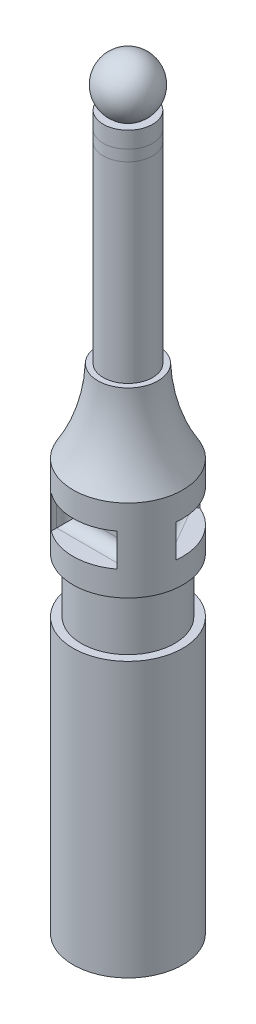
ISO-10303-21;
HEADER;
FILE_DESCRIPTION(('STEP AP214'),'2;1');
FILE_NAME('part.step','',(''),(''),'','','');
FILE_SCHEMA(('AUTOMOTIVE_DESIGN { 1 0 10303 214 1 1 1 1 }'));
ENDSEC;
DATA;
#1=APPLICATION_CONTEXT('core data for automotive mechanical design processes');
#2=APPLICATION_PROTOCOL_DEFINITION('international standard','automotive_design',2000,#1);
#3=PRODUCT_CONTEXT('',#1,'mechanical');
#4=PRODUCT('Part','Part','',(#3));
#5=PRODUCT_RELATED_PRODUCT_CATEGORY('part','',(#4));
#6=PRODUCT_DEFINITION_FORMATION('','',#4);
#7=PRODUCT_DEFINITION_CONTEXT('part definition',#1,'design');
#8=PRODUCT_DEFINITION('design','',#6,#7);
#9=PRODUCT_DEFINITION_SHAPE('','',#8);
#10=(LENGTH_UNIT() NAMED_UNIT(*) SI_UNIT(.MILLI.,.METRE.));
#11=(NAMED_UNIT(*) PLANE_ANGLE_UNIT() SI_UNIT($,.RADIAN.));
#12=(NAMED_UNIT(*) SI_UNIT($,.STERADIAN.) SOLID_ANGLE_UNIT());
#13=UNCERTAINTY_MEASURE_WITH_UNIT(LENGTH_MEASURE(1.E-05),#10,'distance_accuracy_value','');
#14=(GEOMETRIC_REPRESENTATION_CONTEXT(3) GLOBAL_UNCERTAINTY_ASSIGNED_CONTEXT((#13)) GLOBAL_UNIT_ASSIGNED_CONTEXT((#10,
#11,#12)) REPRESENTATION_CONTEXT('',''));
#15=CARTESIAN_POINT('',(0.,0.,0.));
#16=DIRECTION('',(0.,0.,1.));
#17=DIRECTION('',(1.,0.,0.));
#18=AXIS2_PLACEMENT_3D('',#15,#16,#17);
#19=CARTESIAN_POINT('',(0.,91.4579676347439,0.));
#20=DIRECTION('',(0.,1.,0.));
#21=DIRECTION('',(-1.,0.,0.));
#22=AXIS2_PLACEMENT_3D('',#19,#20,#21);
#23=CYLINDRICAL_SURFACE('',#22,4.5);
#24=CARTESIAN_POINT('',(0.,91.4579676347439,0.));
#25=DIRECTION('',(0.,1.,0.));
#26=DIRECTION('',(-1.,0.,0.));
#27=AXIS2_PLACEMENT_3D('',#24,#25,#26);
#28=CIRCLE('',#27,4.5);
#29=CARTESIAN_POINT('',(-4.50000000000001,91.4579676347439,0.));
#30=VERTEX_POINT('',#29);
#31=EDGE_CURVE('E11',#30,#30,#28,.T.);
#32=ORIENTED_EDGE('',*,*,#31,.T.);
#33=EDGE_LOOP('',(#32));
#34=FACE_BOUND('',#33,.T.);
#35=CARTESIAN_POINT('',(0.,93.4579676347439,0.));
#36=DIRECTION('',(0.,1.,0.));
#37=DIRECTION('',(-1.,0.,0.));
#38=AXIS2_PLACEMENT_3D('',#35,#36,#37);
#39=CIRCLE('',#38,4.5);
#40=CARTESIAN_POINT('',(-4.50000000000001,93.4579676347439,0.));
#41=VERTEX_POINT('',#40);
#42=EDGE_CURVE('E47',#41,#41,#39,.T.);
#43=ORIENTED_EDGE('',*,*,#42,.F.);
#44=EDGE_LOOP('',(#43));
#45=FACE_BOUND('',#44,.T.);
#46=ADVANCED_FACE('F44',(#34,#45),#23,.T.);
#47=CARTESIAN_POINT('',(0.,91.4579676347439,0.));
#48=DIRECTION('',(0.,1.,0.));
#49=DIRECTION('',(-1.,0.,0.));
#50=AXIS2_PLACEMENT_3D('',#47,#48,#49);
#51=PLANE('',#50);
#52=ORIENTED_EDGE('',*,*,#31,.F.);
#53=EDGE_LOOP('',(#52));
#54=FACE_BOUND('',#53,.T.);
#55=ADVANCED_FACE('F59',(#54),#51,.F.);
#56=CARTESIAN_POINT('',(0.,93.4579676347439,0.));
#57=DIRECTION('',(0.,1.,0.));
#58=DIRECTION('',(-1.,0.,0.));
#59=AXIS2_PLACEMENT_3D('',#56,#57,#58);
#60=PLANE('',#59);
#61=ORIENTED_EDGE('',*,*,#42,.T.);
#62=EDGE_LOOP('',(#61));
#63=FACE_BOUND('',#62,.T.);
#64=ADVANCED_FACE('F56',(#63),#60,.T.);
#65=CLOSED_SHELL('',(#46,#55,#64));
#66=MANIFOLD_SOLID_BREP('B2',#65);
#67=CARTESIAN_POINT('',(0.,64.0327986592427,0.));
#68=DIRECTION('',(0.,1.,0.));
#69=DIRECTION('',(-1.,0.,0.));
#70=AXIS2_PLACEMENT_3D('',#67,#68,#69);
#71=CYLINDRICAL_SURFACE('',#70,4.5);
#72=CARTESIAN_POINT('',(0.,56.4579676347439,0.));
#73=DIRECTION('',(0.,1.,0.));
#74=DIRECTION('',(-1.,0.,0.));
#75=AXIS2_PLACEMENT_3D('',#72,#73,#74);
#76=CIRCLE('',#75,4.5);
#77=CARTESIAN_POINT('',(-4.5,56.4579676347439,0.));
#78=VERTEX_POINT('',#77);
#79=EDGE_CURVE('E354',#78,#78,#76,.T.);
#80=ORIENTED_EDGE('',*,*,#79,.T.);
#81=EDGE_LOOP('',(#80));
#82=FACE_BOUND('',#81,.T.);
#83=CARTESIAN_POINT('',(0.,91.4579676347439,0.));
#84=DIRECTION('',(0.,1.,0.));
#85=DIRECTION('',(-1.,0.,0.));
#86=AXIS2_PLACEMENT_3D('',#83,#84,#85);
#87=CIRCLE('',#86,4.5);
#88=CARTESIAN_POINT('',(-4.50000000000001,91.4579676347439,0.));
#89=VERTEX_POINT('',#88);
#90=EDGE_CURVE('E280',#89,#89,#87,.T.);
#91=ORIENTED_EDGE('',*,*,#90,.F.);
#92=EDGE_LOOP('',(#91));
#93=FACE_BOUND('',#92,.T.);
#94=ADVANCED_FACE('F84',(#82,#93),#71,.T.);
#95=CARTESIAN_POINT('',(-4.5,56.4579676347439,0.));
#96=DIRECTION('',(0.,1.,0.));
#97=DIRECTION('',(-1.,0.,0.));
#98=AXIS2_PLACEMENT_3D('',#95,#96,#97);
#99=PLANE('',#98);
#100=CARTESIAN_POINT('',(0.,56.4579676347439,0.));
#101=DIRECTION('',(0.,1.,0.));
#102=DIRECTION('',(-1.,0.,0.));
#103=AXIS2_PLACEMENT_3D('',#100,#101,#102);
#104=CIRCLE('',#103,5.5);
#105=CARTESIAN_POINT('',(-5.5,56.4579676347439,0.));
#106=VERTEX_POINT('',#105);
#107=EDGE_CURVE('E359',#106,#106,#104,.T.);
#108=ORIENTED_EDGE('',*,*,#107,.T.);
#109=EDGE_LOOP('',(#108));
#110=FACE_BOUND('',#109,.T.);
#111=ORIENTED_EDGE('',*,*,#79,.F.);
#112=EDGE_LOOP('',(#111));
#113=FACE_BOUND('',#112,.T.);
#114=ADVANCED_FACE('F325',(#110,#113),#99,.T.);
#115=CARTESIAN_POINT('',(0.,57.5167754109723,0.));
#116=DIRECTION('',(0.,1.,0.));
#117=DIRECTION('',(-1.,0.,0.));
#118=AXIS2_PLACEMENT_3D('',#115,#116,#117);
#119=TOROIDAL_SURFACE('',#118,36.2793592540949,30.7975653258442);
#120=CARTESIAN_POINT('',(0.,41.4579676347439,0.));
#121=DIRECTION('',(0.,1.,0.));
#122=DIRECTION('',(-1.,0.,0.));
#123=AXIS2_PLACEMENT_3D('',#120,#121,#122);
#124=CIRCLE('',#123,10.);
#125=CARTESIAN_POINT('',(-10.,41.4579676347439,0.));
#126=VERTEX_POINT('',#125);
#127=EDGE_CURVE('E455',#126,#126,#124,.T.);
#128=ORIENTED_EDGE('',*,*,#127,.T.);
#129=EDGE_LOOP('',(#128));
#130=FACE_BOUND('',#129,.T.);
#131=ORIENTED_EDGE('',*,*,#107,.F.);
#132=EDGE_LOOP('',(#131));
#133=FACE_BOUND('',#132,.T.);
#134=ADVANCED_FACE('F332',(#130,#133),#119,.F.);
#135=CARTESIAN_POINT('',(0.,64.0327986592427,0.));
#136=DIRECTION('',(0.,1.,0.));
#137=DIRECTION('',(-1.,0.,0.));
#138=AXIS2_PLACEMENT_3D('',#135,#136,#137);
#139=CYLINDRICAL_SURFACE('',#138,10.);
#140=DIRECTION('',(0.,1.,0.));
#141=VECTOR('',#140,1.);
#142=CARTESIAN_POINT('',(-9.92820323027549,64.0327986592427,1.19615242270674));
#143=LINE('',#142,#141);
#144=CARTESIAN_POINT('',(-9.92820323027549,30.9579676347439,1.19615242270674));
#145=VERTEX_POINT('',#144);
#146=CARTESIAN_POINT('',(-9.92820323027549,36.9579676347439,1.19615242270674));
#147=VERTEX_POINT('',#146);
#148=EDGE_CURVE('E229',#145,#147,#143,.T.);
#149=ORIENTED_EDGE('',*,*,#148,.F.);
#150=CARTESIAN_POINT('',(0.,30.9579676347439,0.));
#151=DIRECTION('',(0.,-1.,0.));
#152=DIRECTION('',(1.,0.,0.));
#153=AXIS2_PLACEMENT_3D('',#150,#151,#152);
#154=CIRCLE('',#153,10.);
#155=CARTESIAN_POINT('',(-3.9282032302756,30.9579676347439,-9.19615242270659));
#156=VERTEX_POINT('',#155);
#157=EDGE_CURVE('E227',#156,#145,#154,.F.);
#158=ORIENTED_EDGE('',*,*,#157,.F.);
#159=DIRECTION('',(0.,1.,0.));
#160=VECTOR('',#159,1.);
#161=CARTESIAN_POINT('',(-3.9282032302756,64.0327986592427,-9.19615242270659));
#162=LINE('',#161,#160);
#163=CARTESIAN_POINT('',(-3.9282032302756,36.9579676347439,-9.19615242270659));
#164=VERTEX_POINT('',#163);
#165=EDGE_CURVE('E211',#164,#156,#162,.F.);
#166=ORIENTED_EDGE('',*,*,#165,.F.);
#167=CARTESIAN_POINT('',(0.,36.9579676347439,0.));
#168=DIRECTION('',(0.,1.,0.));
#169=DIRECTION('',(-1.,0.,0.));
#170=AXIS2_PLACEMENT_3D('',#167,#168,#169);
#171=CIRCLE('',#170,10.);
#172=EDGE_CURVE('E217',#147,#164,#171,.F.);
#173=ORIENTED_EDGE('',*,*,#172,.F.);
#174=EDGE_LOOP('',(#149,#158,#166,#173));
#175=FACE_BOUND('',#174,.T.);
#176=DIRECTION('',(0.,1.,0.));
#177=VECTOR('',#176,1.);
#178=CARTESIAN_POINT('',(3.92820323027545,64.0327986592427,-9.19615242270666));
#179=LINE('',#178,#177);
#180=CARTESIAN_POINT('',(3.92820323027546,30.9579676347439,-9.19615242270665));
#181=VERTEX_POINT('',#180);
#182=CARTESIAN_POINT('',(3.92820323027546,36.9579676347439,-9.19615242270665));
#183=VERTEX_POINT('',#182);
#184=EDGE_CURVE('E222',#181,#183,#179,.T.);
#185=ORIENTED_EDGE('',*,*,#184,.F.);
#186=CARTESIAN_POINT('',(0.,30.9579676347439,0.));
#187=DIRECTION('',(0.,-1.,0.));
#188=DIRECTION('',(1.,0.,0.));
#189=AXIS2_PLACEMENT_3D('',#186,#187,#188);
#190=CIRCLE('',#189,10.);
#191=CARTESIAN_POINT('',(9.92820323027552,30.9579676347439,1.19615242270658));
#192=VERTEX_POINT('',#191);
#193=EDGE_CURVE('E410',#192,#181,#190,.F.);
#194=ORIENTED_EDGE('',*,*,#193,.F.);
#195=DIRECTION('',(0.,1.,0.));
#196=VECTOR('',#195,1.);
#197=CARTESIAN_POINT('',(9.92820323027551,64.0327986592427,1.19615242270657));
#198=LINE('',#197,#196);
#199=CARTESIAN_POINT('',(9.92820323027552,36.9579676347439,1.19615242270657));
#200=VERTEX_POINT('',#199);
#201=EDGE_CURVE('E407',#200,#192,#198,.F.);
#202=ORIENTED_EDGE('',*,*,#201,.F.);
#203=CARTESIAN_POINT('',(0.,36.9579676347439,0.));
#204=DIRECTION('',(0.,1.,0.));
#205=DIRECTION('',(-1.,0.,0.));
#206=AXIS2_PLACEMENT_3D('',#203,#204,#205);
#207=CIRCLE('',#206,10.);
#208=EDGE_CURVE('E392',#183,#200,#207,.F.);
#209=ORIENTED_EDGE('',*,*,#208,.F.);
#210=EDGE_LOOP('',(#185,#194,#202,#209));
#211=FACE_BOUND('',#210,.T.);
#212=DIRECTION('',(0.,1.,0.));
#213=VECTOR('',#212,1.);
#214=CARTESIAN_POINT('',(6.,64.0327986592427,8.));
#215=LINE('',#214,#213);
#216=CARTESIAN_POINT('',(6.,30.9579676347439,8.));
#217=VERTEX_POINT('',#216);
#218=CARTESIAN_POINT('',(6.,36.9579676347439,8.));
#219=VERTEX_POINT('',#218);
#220=EDGE_CURVE('E371',#217,#219,#215,.T.);
#221=ORIENTED_EDGE('',*,*,#220,.F.);
#222=CARTESIAN_POINT('',(0.,30.9579676347439,0.));
#223=DIRECTION('',(0.,-1.,0.));
#224=DIRECTION('',(0.,0.,-1.));
#225=AXIS2_PLACEMENT_3D('',#222,#223,#224);
#226=CIRCLE('',#225,10.);
#227=CARTESIAN_POINT('',(-6.,30.9579676347439,7.99999999999999));
#228=VERTEX_POINT('',#227);
#229=EDGE_CURVE('E368',#228,#217,#226,.F.);
#230=ORIENTED_EDGE('',*,*,#229,.F.);
#231=DIRECTION('',(0.,1.,0.));
#232=VECTOR('',#231,1.);
#233=CARTESIAN_POINT('',(-6.,64.0327986592427,7.99999999999999));
#234=LINE('',#233,#232);
#235=CARTESIAN_POINT('',(-6.,36.9579676347439,7.99999999999999));
#236=VERTEX_POINT('',#235);
#237=EDGE_CURVE('E365',#236,#228,#234,.F.);
#238=ORIENTED_EDGE('',*,*,#237,.F.);
#239=CARTESIAN_POINT('',(0.,36.9579676347439,0.));
#240=DIRECTION('',(0.,1.,0.));
#241=DIRECTION('',(0.,0.,1.));
#242=AXIS2_PLACEMENT_3D('',#239,#240,#241);
#243=CIRCLE('',#242,10.);
#244=EDGE_CURVE('E357',#219,#236,#243,.F.);
#245=ORIENTED_EDGE('',*,*,#244,.F.);
#246=EDGE_LOOP('',(#221,#230,#238,#245));
#247=FACE_BOUND('',#246,.T.);
#248=CARTESIAN_POINT('',(0.,26.4579676347439,0.));
#249=DIRECTION('',(0.,1.,0.));
#250=DIRECTION('',(-1.,0.,0.));
#251=AXIS2_PLACEMENT_3D('',#248,#249,#250);
#252=CIRCLE('',#251,10.);
#253=CARTESIAN_POINT('',(-9.99999999999999,26.4579676347439,0.));
#254=VERTEX_POINT('',#253);
#255=EDGE_CURVE('E452',#254,#254,#252,.T.);
#256=ORIENTED_EDGE('',*,*,#255,.T.);
#257=EDGE_LOOP('',(#256));
#258=FACE_BOUND('',#257,.T.);
#259=ORIENTED_EDGE('',*,*,#127,.F.);
#260=EDGE_LOOP('',(#259));
#261=FACE_BOUND('',#260,.T.);
#262=ADVANCED_FACE('F224',(#175,#211,#247,#258,#261),#139,.T.);
#263=CARTESIAN_POINT('',(-8.49999999999999,26.4579676347439,0.));
#264=DIRECTION('',(0.,-1.,0.));
#265=DIRECTION('',(1.,0.,0.));
#266=AXIS2_PLACEMENT_3D('',#263,#264,#265);
#267=PLANE('',#266);
#268=CARTESIAN_POINT('',(0.,26.4579676347439,0.));
#269=DIRECTION('',(0.,1.,0.));
#270=DIRECTION('',(-1.,0.,0.));
#271=AXIS2_PLACEMENT_3D('',#268,#269,#270);
#272=CIRCLE('',#271,8.5);
#273=CARTESIAN_POINT('',(-8.49999999999999,26.4579676347439,0.));
#274=VERTEX_POINT('',#273);
#275=EDGE_CURVE('E449',#274,#274,#272,.T.);
#276=ORIENTED_EDGE('',*,*,#275,.T.);
#277=EDGE_LOOP('',(#276));
#278=FACE_BOUND('',#277,.T.);
#279=ORIENTED_EDGE('',*,*,#255,.F.);
#280=EDGE_LOOP('',(#279));
#281=FACE_BOUND('',#280,.T.);
#282=ADVANCED_FACE('F467',(#278,#281),#267,.T.);
#283=CARTESIAN_POINT('',(0.,64.0327986592427,0.));
#284=DIRECTION('',(0.,1.,0.));
#285=DIRECTION('',(-1.,0.,0.));
#286=AXIS2_PLACEMENT_3D('',#283,#284,#285);
#287=CYLINDRICAL_SURFACE('',#286,8.5);
#288=CARTESIAN_POINT('',(0.,16.4579676347439,0.));
#289=DIRECTION('',(0.,1.,0.));
#290=DIRECTION('',(-1.,0.,0.));
#291=AXIS2_PLACEMENT_3D('',#288,#289,#290);
#292=CIRCLE('',#291,8.49999999999999);
#293=CARTESIAN_POINT('',(-8.49999999999999,16.4579676347439,0.));
#294=VERTEX_POINT('',#293);
#295=EDGE_CURVE('E446',#294,#294,#292,.T.);
#296=ORIENTED_EDGE('',*,*,#295,.T.);
#297=EDGE_LOOP('',(#296));
#298=FACE_BOUND('',#297,.T.);
#299=ORIENTED_EDGE('',*,*,#275,.F.);
#300=EDGE_LOOP('',(#299));
#301=FACE_BOUND('',#300,.T.);
#302=ADVANCED_FACE('F472',(#298,#301),#287,.T.);
#303=CARTESIAN_POINT('',(-9.99999999999999,16.4579676347439,0.));
#304=DIRECTION('',(0.,1.,0.));
#305=DIRECTION('',(-1.,0.,0.));
#306=AXIS2_PLACEMENT_3D('',#303,#304,#305);
#307=PLANE('',#306);
#308=CARTESIAN_POINT('',(0.,16.4579676347439,0.));
#309=DIRECTION('',(0.,1.,0.));
#310=DIRECTION('',(-1.,0.,0.));
#311=AXIS2_PLACEMENT_3D('',#308,#309,#310);
#312=CIRCLE('',#311,10.);
#313=CARTESIAN_POINT('',(-9.99999999999999,16.4579676347439,0.));
#314=VERTEX_POINT('',#313);
#315=EDGE_CURVE('E443',#314,#314,#312,.T.);
#316=ORIENTED_EDGE('',*,*,#315,.T.);
#317=EDGE_LOOP('',(#316));
#318=FACE_BOUND('',#317,.T.);
#319=ORIENTED_EDGE('',*,*,#295,.F.);
#320=EDGE_LOOP('',(#319));
#321=FACE_BOUND('',#320,.T.);
#322=ADVANCED_FACE('F476',(#318,#321),#307,.T.);
#323=CARTESIAN_POINT('',(0.,64.0327986592427,0.));
#324=DIRECTION('',(0.,1.,0.));
#325=DIRECTION('',(-1.,0.,0.));
#326=AXIS2_PLACEMENT_3D('',#323,#324,#325);
#327=CYLINDRICAL_SURFACE('',#326,10.);
#328=CARTESIAN_POINT('',(0.,-33.5420323652561,0.));
#329=DIRECTION('',(0.,1.,0.));
#330=DIRECTION('',(-1.,0.,0.));
#331=AXIS2_PLACEMENT_3D('',#328,#329,#330);
#332=CIRCLE('',#331,10.);
#333=CARTESIAN_POINT('',(-9.99999999999999,-33.5420323652561,0.));
#334=VERTEX_POINT('',#333);
#335=EDGE_CURVE('E435',#334,#334,#332,.T.);
#336=ORIENTED_EDGE('',*,*,#335,.T.);
#337=EDGE_LOOP('',(#336));
#338=FACE_BOUND('',#337,.T.);
#339=ORIENTED_EDGE('',*,*,#315,.F.);
#340=EDGE_LOOP('',(#339));
#341=FACE_BOUND('',#340,.T.);
#342=ADVANCED_FACE('F480',(#338,#341),#327,.T.);
#343=CARTESIAN_POINT('',(-9.99999999999999,-33.5420323652561,0.));
#344=DIRECTION('',(0.,-1.,0.));
#345=DIRECTION('',(1.,0.,0.));
#346=AXIS2_PLACEMENT_3D('',#343,#344,#345);
#347=PLANE('',#346);
#348=ORIENTED_EDGE('',*,*,#335,.F.);
#349=EDGE_LOOP('',(#348));
#350=FACE_BOUND('',#349,.T.);
#351=ADVANCED_FACE('F484',(#350),#347,.T.);
#352=CARTESIAN_POINT('',(6.,36.9579676347439,5.));
#353=DIRECTION('',(1.,0.,0.));
#354=DIRECTION('',(0.,0.,-1.));
#355=AXIS2_PLACEMENT_3D('',#352,#353,#354);
#356=PLANE('',#355);
#357=DIRECTION('',(0.,0.,1.));
#358=VECTOR('',#357,1.);
#359=CARTESIAN_POINT('',(6.,36.9579676347439,5.));
#360=LINE('',#359,#358);
#361=CARTESIAN_POINT('',(6.,36.9579676347439,7.));
#362=VERTEX_POINT('',#361);
#363=EDGE_CURVE('E404',#362,#219,#360,.T.);
#364=ORIENTED_EDGE('',*,*,#363,.F.);
#365=DIRECTION('',(0.,1.,0.));
#366=VECTOR('',#365,1.);
#367=CARTESIAN_POINT('',(6.,36.9579676347439,7.));
#368=LINE('',#367,#366);
#369=CARTESIAN_POINT('',(6.,30.9579676347439,7.));
#370=VERTEX_POINT('',#369);
#371=EDGE_CURVE('E386',#362,#370,#368,.F.);
#372=ORIENTED_EDGE('',*,*,#371,.T.);
#373=DIRECTION('',(0.,0.,1.));
#374=VECTOR('',#373,1.);
#375=CARTESIAN_POINT('',(6.,30.9579676347439,5.));
#376=LINE('',#375,#374);
#377=EDGE_CURVE('E433',#370,#217,#376,.T.);
#378=ORIENTED_EDGE('',*,*,#377,.T.);
#379=ORIENTED_EDGE('',*,*,#220,.T.);
#380=EDGE_LOOP('',(#364,#372,#378,#379));
#381=FACE_BOUND('',#380,.T.);
#382=ADVANCED_FACE('F488',(#381),#356,.F.);
#383=CARTESIAN_POINT('',(-6.,30.9579676347439,5.));
#384=DIRECTION('',(0.,-1.,0.));
#385=DIRECTION('',(0.,0.,-1.));
#386=AXIS2_PLACEMENT_3D('',#383,#384,#385);
#387=PLANE('',#386);
#388=ORIENTED_EDGE('',*,*,#377,.F.);
#389=DIRECTION('',(1.,0.,0.));
#390=VECTOR('',#389,1.);
#391=CARTESIAN_POINT('',(-6.,30.9579676347439,7.));
#392=LINE('',#391,#390);
#393=CARTESIAN_POINT('',(-6.,30.9579676347439,7.));
#394=VERTEX_POINT('',#393);
#395=EDGE_CURVE('E383',#370,#394,#392,.F.);
#396=ORIENTED_EDGE('',*,*,#395,.T.);
#397=DIRECTION('',(0.,0.,1.));
#398=VECTOR('',#397,1.);
#399=CARTESIAN_POINT('',(-6.,30.9579676347439,5.));
#400=LINE('',#399,#398);
#401=EDGE_CURVE('E436',#394,#228,#400,.T.);
#402=ORIENTED_EDGE('',*,*,#401,.T.);
#403=ORIENTED_EDGE('',*,*,#229,.T.);
#404=EDGE_LOOP('',(#388,#396,#402,#403));
#405=FACE_BOUND('',#404,.T.);
#406=ADVANCED_FACE('F492',(#405),#387,.F.);
#407=CARTESIAN_POINT('',(-6.,36.9579676347439,5.));
#408=DIRECTION('',(-1.,0.,0.));
#409=DIRECTION('',(0.,-1.,0.));
#410=AXIS2_PLACEMENT_3D('',#407,#408,#409);
#411=PLANE('',#410);
#412=ORIENTED_EDGE('',*,*,#401,.F.);
#413=DIRECTION('',(0.,-1.,0.));
#414=VECTOR('',#413,1.);
#415=CARTESIAN_POINT('',(-6.,36.9579676347439,7.));
#416=LINE('',#415,#414);
#417=CARTESIAN_POINT('',(-6.,36.9579676347439,7.));
#418=VERTEX_POINT('',#417);
#419=EDGE_CURVE('E390',#394,#418,#416,.F.);
#420=ORIENTED_EDGE('',*,*,#419,.T.);
#421=DIRECTION('',(0.,0.,1.));
#422=VECTOR('',#421,1.);
#423=CARTESIAN_POINT('',(-6.,36.9579676347439,5.));
#424=LINE('',#423,#422);
#425=EDGE_CURVE('E438',#418,#236,#424,.T.);
#426=ORIENTED_EDGE('',*,*,#425,.T.);
#427=ORIENTED_EDGE('',*,*,#237,.T.);
#428=EDGE_LOOP('',(#412,#420,#426,#427));
#429=FACE_BOUND('',#428,.T.);
#430=ADVANCED_FACE('F498',(#429),#411,.F.);
#431=CARTESIAN_POINT('',(-6.,36.9579676347439,5.));
#432=DIRECTION('',(0.,1.,0.));
#433=DIRECTION('',(0.,0.,1.));
#434=AXIS2_PLACEMENT_3D('',#431,#432,#433);
#435=PLANE('',#434);
#436=ORIENTED_EDGE('',*,*,#425,.F.);
#437=DIRECTION('',(-1.,0.,0.));
#438=VECTOR('',#437,1.);
#439=CARTESIAN_POINT('',(-6.,36.9579676347439,7.));
#440=LINE('',#439,#438);
#441=EDGE_CURVE('E388',#418,#362,#440,.F.);
#442=ORIENTED_EDGE('',*,*,#441,.T.);
#443=ORIENTED_EDGE('',*,*,#363,.T.);
#444=ORIENTED_EDGE('',*,*,#244,.T.);
#445=EDGE_LOOP('',(#436,#442,#443,#444));
#446=FACE_BOUND('',#445,.T.);
#447=ADVANCED_FACE('F494',(#446),#435,.F.);
#448=CARTESIAN_POINT('',(0.,0.,5.));
#449=DIRECTION('',(0.,0.,1.));
#450=DIRECTION('',(1.,0.,0.));
#451=AXIS2_PLACEMENT_3D('',#448,#449,#450);
#452=PLANE('',#451);
#453=DIRECTION('',(0.,-1.,0.));
#454=VECTOR('',#453,1.);
#455=CARTESIAN_POINT('',(-3.99999999999999,0.,5.));
#456=LINE('',#455,#454);
#457=CARTESIAN_POINT('',(-4.,34.9579676347439,5.));
#458=VERTEX_POINT('',#457);
#459=CARTESIAN_POINT('',(-4.,32.9579676347439,5.));
#460=VERTEX_POINT('',#459);
#461=EDGE_CURVE('E374',#458,#460,#456,.T.);
#462=ORIENTED_EDGE('',*,*,#461,.T.);
#463=DIRECTION('',(1.,0.,0.));
#464=VECTOR('',#463,1.);
#465=CARTESIAN_POINT('',(0.,32.9579676347439,5.));
#466=LINE('',#465,#464);
#467=CARTESIAN_POINT('',(4.,32.9579676347439,5.));
#468=VERTEX_POINT('',#467);
#469=EDGE_CURVE('E380',#460,#468,#466,.T.);
#470=ORIENTED_EDGE('',*,*,#469,.T.);
#471=DIRECTION('',(0.,1.,0.));
#472=VECTOR('',#471,1.);
#473=CARTESIAN_POINT('',(4.,0.,5.));
#474=LINE('',#473,#472);
#475=CARTESIAN_POINT('',(4.,34.9579676347439,5.));
#476=VERTEX_POINT('',#475);
#477=EDGE_CURVE('E378',#468,#476,#474,.T.);
#478=ORIENTED_EDGE('',*,*,#477,.T.);
#479=DIRECTION('',(-1.,0.,0.));
#480=VECTOR('',#479,1.);
#481=CARTESIAN_POINT('',(0.,34.9579676347439,5.));
#482=LINE('',#481,#480);
#483=EDGE_CURVE('E376',#476,#458,#482,.T.);
#484=ORIENTED_EDGE('',*,*,#483,.T.);
#485=EDGE_LOOP('',(#462,#470,#478,#484));
#486=FACE_BOUND('',#485,.T.);
#487=ADVANCED_FACE('F497',(#486),#452,.T.);
#488=CARTESIAN_POINT('',(0.,34.9579676347439,7.));
#489=DIRECTION('',(-1.,0.,0.));
#490=DIRECTION('',(0.,0.,1.));
#491=AXIS2_PLACEMENT_3D('',#488,#489,#490);
#492=CYLINDRICAL_SURFACE('',#491,2.);
#493=CARTESIAN_POINT('',(4.,34.9579676347439,7.));
#494=DIRECTION('',(-0.707106781186547,0.707106781186547,0.));
#495=DIRECTION('',(0.707106781186547,0.707106781186547,0.));
#496=AXIS2_PLACEMENT_3D('',#493,#494,#495);
#497=ELLIPSE('',#496,2.82842712474619,2.);
#498=EDGE_CURVE('E398',#362,#476,#497,.T.);
#499=ORIENTED_EDGE('',*,*,#498,.F.);
#500=ORIENTED_EDGE('',*,*,#441,.F.);
#501=CARTESIAN_POINT('',(-4.,34.9579676347439,7.));
#502=DIRECTION('',(-0.707106781186547,-0.707106781186548,0.));
#503=DIRECTION('',(-0.707106781186548,0.707106781186547,0.));
#504=AXIS2_PLACEMENT_3D('',#501,#502,#503);
#505=ELLIPSE('',#504,2.82842712474619,2.);
#506=EDGE_CURVE('E401',#458,#418,#505,.F.);
#507=ORIENTED_EDGE('',*,*,#506,.F.);
#508=ORIENTED_EDGE('',*,*,#483,.F.);
#509=EDGE_LOOP('',(#499,#500,#507,#508));
#510=FACE_BOUND('',#509,.T.);
#511=ADVANCED_FACE('F508',(#510),#492,.F.);
#512=CARTESIAN_POINT('',(-3.99999999999999,0.,7.));
#513=DIRECTION('',(0.,-1.,0.));
#514=DIRECTION('',(1.,0.,0.));
#515=AXIS2_PLACEMENT_3D('',#512,#513,#514);
#516=CYLINDRICAL_SURFACE('',#515,2.);
#517=ORIENTED_EDGE('',*,*,#506,.T.);
#518=ORIENTED_EDGE('',*,*,#419,.F.);
#519=CARTESIAN_POINT('',(-4.,32.9579676347439,7.));
#520=DIRECTION('',(0.707106781186548,-0.707106781186547,0.));
#521=DIRECTION('',(0.707106781186547,0.707106781186548,0.));
#522=AXIS2_PLACEMENT_3D('',#519,#520,#521);
#523=ELLIPSE('',#522,2.82842712474619,2.);
#524=EDGE_CURVE('E395',#460,#394,#523,.F.);
#525=ORIENTED_EDGE('',*,*,#524,.F.);
#526=ORIENTED_EDGE('',*,*,#461,.F.);
#527=EDGE_LOOP('',(#517,#518,#525,#526));
#528=FACE_BOUND('',#527,.T.);
#529=ADVANCED_FACE('F768',(#528),#516,.F.);
#530=CARTESIAN_POINT('',(4.,0.,7.));
#531=DIRECTION('',(0.,1.,0.));
#532=DIRECTION('',(0.,0.,1.));
#533=AXIS2_PLACEMENT_3D('',#530,#531,#532);
#534=CYLINDRICAL_SURFACE('',#533,2.);
#535=ORIENTED_EDGE('',*,*,#498,.T.);
#536=ORIENTED_EDGE('',*,*,#477,.F.);
#537=CARTESIAN_POINT('',(4.,32.9579676347439,7.));
#538=DIRECTION('',(0.707106781186547,0.707106781186547,0.));
#539=DIRECTION('',(0.707106781186547,-0.707106781186547,0.));
#540=AXIS2_PLACEMENT_3D('',#537,#538,#539);
#541=ELLIPSE('',#540,2.82842712474619,2.);
#542=EDGE_CURVE('E393',#370,#468,#541,.T.);
#543=ORIENTED_EDGE('',*,*,#542,.F.);
#544=ORIENTED_EDGE('',*,*,#371,.F.);
#545=EDGE_LOOP('',(#535,#536,#543,#544));
#546=FACE_BOUND('',#545,.T.);
#547=ADVANCED_FACE('F778',(#546),#534,.F.);
#548=CARTESIAN_POINT('',(0.,32.9579676347439,7.));
#549=DIRECTION('',(1.,0.,0.));
#550=DIRECTION('',(0.,0.,-1.));
#551=AXIS2_PLACEMENT_3D('',#548,#549,#550);
#552=CYLINDRICAL_SURFACE('',#551,2.);
#553=ORIENTED_EDGE('',*,*,#524,.T.);
#554=ORIENTED_EDGE('',*,*,#395,.F.);
#555=ORIENTED_EDGE('',*,*,#542,.T.);
#556=ORIENTED_EDGE('',*,*,#469,.F.);
#557=EDGE_LOOP('',(#553,#554,#555,#556));
#558=FACE_BOUND('',#557,.T.);
#559=ADVANCED_FACE('F513',(#558),#552,.F.);
#560=CARTESIAN_POINT('',(1.33012701892216,36.9579676347439,-7.69615242270665));
#561=DIRECTION('',(-0.500000000000004,0.,-0.866025403784436));
#562=DIRECTION('',(-0.866025403784436,0.,0.500000000000004));
#563=AXIS2_PLACEMENT_3D('',#560,#561,#562);
#564=PLANE('',#563);
#565=DIRECTION('',(0.866025403784436,0.,-0.500000000000004));
#566=VECTOR('',#565,1.);
#567=CARTESIAN_POINT('',(1.33012701892216,36.9579676347439,-7.69615242270665));
#568=LINE('',#567,#566);
#569=CARTESIAN_POINT('',(3.06217782649103,36.9579676347439,-8.69615242270666));
#570=VERTEX_POINT('',#569);
#571=EDGE_CURVE('E304',#570,#183,#568,.T.);
#572=ORIENTED_EDGE('',*,*,#571,.F.);
#573=DIRECTION('',(0.,1.,0.));
#574=VECTOR('',#573,1.);
#575=CARTESIAN_POINT('',(3.06217782649103,36.9579676347439,-8.69615242270666));
#576=LINE('',#575,#574);
#577=CARTESIAN_POINT('',(3.06217782649103,30.9579676347439,-8.69615242270666));
#578=VERTEX_POINT('',#577);
#579=EDGE_CURVE('E246',#570,#578,#576,.F.);
#580=ORIENTED_EDGE('',*,*,#579,.T.);
#581=DIRECTION('',(0.866025403784436,0.,-0.500000000000004));
#582=VECTOR('',#581,1.);
#583=CARTESIAN_POINT('',(1.33012701892216,30.9579676347439,-7.69615242270665));
#584=LINE('',#583,#582);
#585=EDGE_CURVE('E396',#578,#181,#584,.T.);
#586=ORIENTED_EDGE('',*,*,#585,.T.);
#587=ORIENTED_EDGE('',*,*,#184,.T.);
#588=EDGE_LOOP('',(#572,#580,#586,#587));
#589=FACE_BOUND('',#588,.T.);
#590=ADVANCED_FACE('F417',(#589),#564,.F.);
#591=CARTESIAN_POINT('',(7.3301270189222,30.9579676347439,2.69615242270659));
#592=DIRECTION('',(0.,-1.,0.));
#593=DIRECTION('',(1.,0.,0.));
#594=AXIS2_PLACEMENT_3D('',#591,#592,#593);
#595=PLANE('',#594);
#596=ORIENTED_EDGE('',*,*,#585,.F.);
#597=DIRECTION('',(-0.500000000000004,0.,-0.866025403784436));
#598=VECTOR('',#597,1.);
#599=CARTESIAN_POINT('',(9.06217782649108,30.9579676347439,1.69615242270658));
#600=LINE('',#599,#598);
#601=CARTESIAN_POINT('',(9.06217782649108,30.9579676347439,1.69615242270658));
#602=VERTEX_POINT('',#601);
#603=EDGE_CURVE('E243',#578,#602,#600,.F.);
#604=ORIENTED_EDGE('',*,*,#603,.T.);
#605=DIRECTION('',(0.866025403784436,0.,-0.500000000000004));
#606=VECTOR('',#605,1.);
#607=CARTESIAN_POINT('',(7.3301270189222,30.9579676347439,2.69615242270659));
#608=LINE('',#607,#606);
#609=EDGE_CURVE('E429',#602,#192,#608,.T.);
#610=ORIENTED_EDGE('',*,*,#609,.T.);
#611=ORIENTED_EDGE('',*,*,#193,.T.);
#612=EDGE_LOOP('',(#596,#604,#610,#611));
#613=FACE_BOUND('',#612,.T.);
#614=ADVANCED_FACE('F512',(#613),#595,.F.);
#615=CARTESIAN_POINT('',(7.3301270189222,36.9579676347439,2.69615242270659));
#616=DIRECTION('',(0.500000000000004,0.,0.866025403784436));
#617=DIRECTION('',(0.866025403784436,0.,-0.500000000000004));
#618=AXIS2_PLACEMENT_3D('',#615,#616,#617);
#619=PLANE('',#618);
#620=ORIENTED_EDGE('',*,*,#609,.F.);
#621=DIRECTION('',(0.,-1.,0.));
#622=VECTOR('',#621,1.);
#623=CARTESIAN_POINT('',(9.06217782649108,36.9579676347439,1.69615242270658));
#624=LINE('',#623,#622);
#625=CARTESIAN_POINT('',(9.06217782649107,36.9579676347439,1.69615242270658));
#626=VERTEX_POINT('',#625);
#627=EDGE_CURVE('E250',#602,#626,#624,.F.);
#628=ORIENTED_EDGE('',*,*,#627,.T.);
#629=DIRECTION('',(0.866025403784436,0.,-0.500000000000004));
#630=VECTOR('',#629,1.);
#631=CARTESIAN_POINT('',(7.3301270189222,36.9579676347439,2.69615242270659));
#632=LINE('',#631,#630);
#633=EDGE_CURVE('E426',#626,#200,#632,.T.);
#634=ORIENTED_EDGE('',*,*,#633,.T.);
#635=ORIENTED_EDGE('',*,*,#201,.T.);
#636=EDGE_LOOP('',(#620,#628,#634,#635));
#637=FACE_BOUND('',#636,.T.);
#638=ADVANCED_FACE('F517',(#637),#619,.F.);
#639=CARTESIAN_POINT('',(7.3301270189222,36.9579676347439,2.69615242270659));
#640=DIRECTION('',(0.,1.,0.));
#641=DIRECTION('',(-1.,0.,0.));
#642=AXIS2_PLACEMENT_3D('',#639,#640,#641);
#643=PLANE('',#642);
#644=ORIENTED_EDGE('',*,*,#633,.F.);
#645=DIRECTION('',(0.500000000000004,0.,0.866025403784436));
#646=VECTOR('',#645,1.);
#647=CARTESIAN_POINT('',(9.06217782649107,36.9579676347439,1.69615242270658));
#648=LINE('',#647,#646);
#649=EDGE_CURVE('E248',#626,#570,#648,.F.);
#650=ORIENTED_EDGE('',*,*,#649,.T.);
#651=ORIENTED_EDGE('',*,*,#571,.T.);
#652=ORIENTED_EDGE('',*,*,#208,.T.);
#653=EDGE_LOOP('',(#644,#650,#651,#652));
#654=FACE_BOUND('',#653,.T.);
#655=ADVANCED_FACE('F425',(#654),#643,.F.);
#656=CARTESIAN_POINT('',(4.33012701892219,0.,-2.50000000000002));
#657=DIRECTION('',(0.866025403784436,0.,-0.500000000000004));
#658=DIRECTION('',(-0.500000000000004,0.,-0.866025403784436));
#659=AXIS2_PLACEMENT_3D('',#656,#657,#658);
#660=PLANE('',#659);
#661=DIRECTION('',(0.,-1.,0.));
#662=VECTOR('',#661,1.);
#663=CARTESIAN_POINT('',(6.3301270189222,0.,0.964101615137717));
#664=LINE('',#663,#662);
#665=CARTESIAN_POINT('',(6.3301270189222,34.9579676347439,0.964101615137718));
#666=VERTEX_POINT('',#665);
#667=CARTESIAN_POINT('',(6.3301270189222,32.9579676347439,0.964101615137718));
#668=VERTEX_POINT('',#667);
#669=EDGE_CURVE('E234',#666,#668,#664,.T.);
#670=ORIENTED_EDGE('',*,*,#669,.T.);
#671=DIRECTION('',(-0.500000000000004,0.,-0.866025403784436));
#672=VECTOR('',#671,1.);
#673=CARTESIAN_POINT('',(4.33012701892218,32.9579676347439,-2.50000000000003));
#674=LINE('',#673,#672);
#675=CARTESIAN_POINT('',(2.33012701892216,32.9579676347439,-5.96410161513777));
#676=VERTEX_POINT('',#675);
#677=EDGE_CURVE('E240',#668,#676,#674,.T.);
#678=ORIENTED_EDGE('',*,*,#677,.T.);
#679=DIRECTION('',(0.,1.,0.));
#680=VECTOR('',#679,1.);
#681=CARTESIAN_POINT('',(2.33012701892217,0.,-5.96410161513777));
#682=LINE('',#681,#680);
#683=CARTESIAN_POINT('',(2.33012701892216,34.9579676347439,-5.96410161513777));
#684=VERTEX_POINT('',#683);
#685=EDGE_CURVE('E238',#676,#684,#682,.T.);
#686=ORIENTED_EDGE('',*,*,#685,.T.);
#687=DIRECTION('',(0.500000000000004,0.,0.866025403784436));
#688=VECTOR('',#687,1.);
#689=CARTESIAN_POINT('',(4.33012701892218,34.9579676347439,-2.50000000000003));
#690=LINE('',#689,#688);
#691=EDGE_CURVE('E236',#684,#666,#690,.T.);
#692=ORIENTED_EDGE('',*,*,#691,.T.);
#693=EDGE_LOOP('',(#670,#678,#686,#692));
#694=FACE_BOUND('',#693,.T.);
#695=ADVANCED_FACE('F516',(#694),#660,.T.);
#696=CARTESIAN_POINT('',(-7.33012701892217,36.9579676347439,2.6961524227067));
#697=DIRECTION('',(-0.499999999999992,0.,0.866025403784443));
#698=DIRECTION('',(0.866025403784443,0.,0.499999999999992));
#699=AXIS2_PLACEMENT_3D('',#696,#697,#698);
#700=PLANE('',#699);
#701=DIRECTION('',(-0.866025403784443,0.,-0.499999999999992));
#702=VECTOR('',#701,1.);
#703=CARTESIAN_POINT('',(-7.33012701892217,36.9579676347439,2.6961524227067));
#704=LINE('',#703,#702);
#705=CARTESIAN_POINT('',(-9.06217782649106,36.9579676347439,1.69615242270672));
#706=VERTEX_POINT('',#705);
#707=EDGE_CURVE('E214',#706,#147,#704,.T.);
#708=ORIENTED_EDGE('',*,*,#707,.F.);
#709=DIRECTION('',(0.,1.,0.));
#710=VECTOR('',#709,1.);
#711=CARTESIAN_POINT('',(-9.06217782649106,36.9579676347439,1.69615242270672));
#712=LINE('',#711,#710);
#713=CARTESIAN_POINT('',(-9.06217782649106,30.9579676347439,1.69615242270672));
#714=VERTEX_POINT('',#713);
#715=EDGE_CURVE('E274',#706,#714,#712,.F.);
#716=ORIENTED_EDGE('',*,*,#715,.T.);
#717=DIRECTION('',(-0.866025403784443,0.,-0.499999999999992));
#718=VECTOR('',#717,1.);
#719=CARTESIAN_POINT('',(-7.33012701892217,30.9579676347439,2.6961524227067));
#720=LINE('',#719,#718);
#721=EDGE_CURVE('E300',#714,#145,#720,.T.);
#722=ORIENTED_EDGE('',*,*,#721,.T.);
#723=ORIENTED_EDGE('',*,*,#148,.T.);
#724=EDGE_LOOP('',(#708,#716,#722,#723));
#725=FACE_BOUND('',#724,.T.);
#726=ADVANCED_FACE('F299',(#725),#700,.F.);
#727=CARTESIAN_POINT('',(-1.33012701892227,30.9579676347439,-7.69615242270662));
#728=DIRECTION('',(0.,-1.,0.));
#729=DIRECTION('',(1.,0.,0.));
#730=AXIS2_PLACEMENT_3D('',#727,#728,#729);
#731=PLANE('',#730);
#732=ORIENTED_EDGE('',*,*,#721,.F.);
#733=DIRECTION('',(-0.499999999999992,0.,0.866025403784443));
#734=VECTOR('',#733,1.);
#735=CARTESIAN_POINT('',(-3.06217782649116,30.9579676347439,-8.6961524227066));
#736=LINE('',#735,#734);
#737=CARTESIAN_POINT('',(-3.06217782649116,30.9579676347439,-8.6961524227066));
#738=VERTEX_POINT('',#737);
#739=EDGE_CURVE('E271',#714,#738,#736,.F.);
#740=ORIENTED_EDGE('',*,*,#739,.T.);
#741=DIRECTION('',(-0.866025403784443,0.,-0.499999999999992));
#742=VECTOR('',#741,1.);
#743=CARTESIAN_POINT('',(-1.33012701892227,30.9579676347439,-7.69615242270662));
#744=LINE('',#743,#742);
#745=EDGE_CURVE('E213',#738,#156,#744,.T.);
#746=ORIENTED_EDGE('',*,*,#745,.T.);
#747=ORIENTED_EDGE('',*,*,#157,.T.);
#748=EDGE_LOOP('',(#732,#740,#746,#747));
#749=FACE_BOUND('',#748,.T.);
#750=ADVANCED_FACE('F303',(#749),#731,.F.);
#751=CARTESIAN_POINT('',(-1.33012701892227,36.9579676347439,-7.69615242270662));
#752=DIRECTION('',(0.499999999999992,0.,-0.866025403784443));
#753=DIRECTION('',(-0.866025403784443,0.,-0.499999999999992));
#754=AXIS2_PLACEMENT_3D('',#751,#752,#753);
#755=PLANE('',#754);
#756=ORIENTED_EDGE('',*,*,#745,.F.);
#757=DIRECTION('',(0.,-1.,0.));
#758=VECTOR('',#757,1.);
#759=CARTESIAN_POINT('',(-3.06217782649116,36.9579676347439,-8.6961524227066));
#760=LINE('',#759,#758);
#761=CARTESIAN_POINT('',(-3.06217782649116,36.9579676347439,-8.6961524227066));
#762=VERTEX_POINT('',#761);
#763=EDGE_CURVE('E42',#738,#762,#760,.F.);
#764=ORIENTED_EDGE('',*,*,#763,.T.);
#765=DIRECTION('',(-0.866025403784443,0.,-0.499999999999992));
#766=VECTOR('',#765,1.);
#767=CARTESIAN_POINT('',(-1.33012701892227,36.9579676347439,-7.69615242270662));
#768=LINE('',#767,#766);
#769=EDGE_CURVE('E207',#762,#164,#768,.T.);
#770=ORIENTED_EDGE('',*,*,#769,.T.);
#771=ORIENTED_EDGE('',*,*,#165,.T.);
#772=EDGE_LOOP('',(#756,#764,#770,#771));
#773=FACE_BOUND('',#772,.T.);
#774=ADVANCED_FACE('F209',(#773),#755,.F.);
#775=CARTESIAN_POINT('',(-1.33012701892227,36.9579676347439,-7.69615242270662));
#776=DIRECTION('',(0.,1.,0.));
#777=DIRECTION('',(-1.,0.,0.));
#778=AXIS2_PLACEMENT_3D('',#775,#776,#777);
#779=PLANE('',#778);
#780=ORIENTED_EDGE('',*,*,#769,.F.);
#781=DIRECTION('',(0.499999999999992,0.,-0.866025403784443));
#782=VECTOR('',#781,1.);
#783=CARTESIAN_POINT('',(-3.06217782649116,36.9579676347439,-8.6961524227066));
#784=LINE('',#783,#782);
#785=EDGE_CURVE('E93',#762,#706,#784,.F.);
#786=ORIENTED_EDGE('',*,*,#785,.T.);
#787=ORIENTED_EDGE('',*,*,#707,.T.);
#788=ORIENTED_EDGE('',*,*,#172,.T.);
#789=EDGE_LOOP('',(#780,#786,#787,#788));
#790=FACE_BOUND('',#789,.T.);
#791=ADVANCED_FACE('F218',(#790),#779,.F.);
#792=CARTESIAN_POINT('',(-4.33012701892222,0.,-2.49999999999996));
#793=DIRECTION('',(-0.866025403784443,0.,-0.499999999999992));
#794=DIRECTION('',(-0.499999999999992,0.,0.866025403784443));
#795=AXIS2_PLACEMENT_3D('',#792,#793,#794);
#796=PLANE('',#795);
#797=DIRECTION('',(0.,-1.,0.));
#798=VECTOR('',#797,1.);
#799=CARTESIAN_POINT('',(-2.33012701892225,0.,-5.96410161513773));
#800=LINE('',#799,#798);
#801=CARTESIAN_POINT('',(-2.33012701892226,34.9579676347439,-5.96410161513773));
#802=VERTEX_POINT('',#801);
#803=CARTESIAN_POINT('',(-2.33012701892226,32.9579676347439,-5.96410161513773));
#804=VERTEX_POINT('',#803);
#805=EDGE_CURVE('E252',#802,#804,#800,.T.);
#806=ORIENTED_EDGE('',*,*,#805,.T.);
#807=DIRECTION('',(-0.499999999999992,0.,0.866025403784443));
#808=VECTOR('',#807,1.);
#809=CARTESIAN_POINT('',(-4.33012701892222,32.9579676347439,-2.49999999999996));
#810=LINE('',#809,#808);
#811=CARTESIAN_POINT('',(-6.33012701892219,32.9579676347439,0.964101615137816));
#812=VERTEX_POINT('',#811);
#813=EDGE_CURVE('E268',#804,#812,#810,.T.);
#814=ORIENTED_EDGE('',*,*,#813,.T.);
#815=DIRECTION('',(0.,1.,0.));
#816=VECTOR('',#815,1.);
#817=CARTESIAN_POINT('',(-6.33012701892219,0.,0.964101615137812));
#818=LINE('',#817,#816);
#819=CARTESIAN_POINT('',(-6.33012701892219,34.9579676347439,0.964101615137816));
#820=VERTEX_POINT('',#819);
#821=EDGE_CURVE('E266',#812,#820,#818,.T.);
#822=ORIENTED_EDGE('',*,*,#821,.T.);
#823=DIRECTION('',(0.499999999999992,0.,-0.866025403784443));
#824=VECTOR('',#823,1.);
#825=CARTESIAN_POINT('',(-4.33012701892222,34.9579676347439,-2.49999999999996));
#826=LINE('',#825,#824);
#827=EDGE_CURVE('E264',#820,#802,#826,.T.);
#828=ORIENTED_EDGE('',*,*,#827,.T.);
#829=EDGE_LOOP('',(#806,#814,#822,#828));
#830=FACE_BOUND('',#829,.T.);
#831=ADVANCED_FACE('F310',(#830),#796,.T.);
#832=CARTESIAN_POINT('',(6.06217782649105,34.9579676347439,-3.50000000000004));
#833=DIRECTION('',(0.500000000000004,0.,0.866025403784436));
#834=DIRECTION('',(0.866025403784436,0.,-0.500000000000004));
#835=AXIS2_PLACEMENT_3D('',#832,#833,#834);
#836=CYLINDRICAL_SURFACE('',#835,2.);
#837=CARTESIAN_POINT('',(4.06217782649104,34.9579676347439,-6.96410161513778));
#838=DIRECTION('',(0.353553390593276,0.707106781186548,0.612372435695793));
#839=DIRECTION('',(-0.353553390593277,0.707106781186547,-0.612372435695793));
#840=AXIS2_PLACEMENT_3D('',#837,#838,#839);
#841=ELLIPSE('',#840,2.82842712474619,2.);
#842=EDGE_CURVE('E257',#570,#684,#841,.T.);
#843=ORIENTED_EDGE('',*,*,#842,.F.);
#844=ORIENTED_EDGE('',*,*,#649,.F.);
#845=CARTESIAN_POINT('',(8.06217782649107,34.9579676347439,-0.0358983848622901));
#846=DIRECTION('',(0.353553390593277,-0.707106781186547,0.612372435695793));
#847=DIRECTION('',(0.353553390593276,0.707106781186548,0.612372435695793));
#848=AXIS2_PLACEMENT_3D('',#845,#846,#847);
#849=ELLIPSE('',#848,2.82842712474619,2.);
#850=EDGE_CURVE('E260',#666,#626,#849,.F.);
#851=ORIENTED_EDGE('',*,*,#850,.F.);
#852=ORIENTED_EDGE('',*,*,#691,.F.);
#853=EDGE_LOOP('',(#843,#844,#851,#852));
#854=FACE_BOUND('',#853,.T.);
#855=ADVANCED_FACE('F312',(#854),#836,.F.);
#856=CARTESIAN_POINT('',(8.06217782649107,0.,-0.0358983848622913));
#857=DIRECTION('',(0.,-1.,0.));
#858=DIRECTION('',(1.,0.,0.));
#859=AXIS2_PLACEMENT_3D('',#856,#857,#858);
#860=CYLINDRICAL_SURFACE('',#859,2.);
#861=ORIENTED_EDGE('',*,*,#850,.T.);
#862=ORIENTED_EDGE('',*,*,#627,.F.);
#863=CARTESIAN_POINT('',(8.06217782649107,32.9579676347439,-0.0358983848622905));
#864=DIRECTION('',(-0.353553390593276,-0.707106781186548,-0.612372435695793));
#865=DIRECTION('',(-0.353553390593277,0.707106781186547,-0.612372435695793));
#866=AXIS2_PLACEMENT_3D('',#863,#864,#865);
#867=ELLIPSE('',#866,2.82842712474619,2.);
#868=EDGE_CURVE('E255',#668,#602,#867,.F.);
#869=ORIENTED_EDGE('',*,*,#868,.F.);
#870=ORIENTED_EDGE('',*,*,#669,.F.);
#871=EDGE_LOOP('',(#861,#862,#869,#870));
#872=FACE_BOUND('',#871,.T.);
#873=ADVANCED_FACE('F318',(#872),#860,.F.);
#874=CARTESIAN_POINT('',(4.06217782649104,0.,-6.96410161513778));
#875=DIRECTION('',(0.,1.,0.));
#876=DIRECTION('',(-1.,0.,0.));
#877=AXIS2_PLACEMENT_3D('',#874,#875,#876);
#878=CYLINDRICAL_SURFACE('',#877,2.);
#879=ORIENTED_EDGE('',*,*,#842,.T.);
#880=ORIENTED_EDGE('',*,*,#685,.F.);
#881=CARTESIAN_POINT('',(4.06217782649104,32.9579676347439,-6.96410161513778));
#882=DIRECTION('',(-0.353553390593277,0.707106781186547,-0.612372435695793));
#883=DIRECTION('',(-0.353553390593276,-0.707106781186548,-0.612372435695793));
#884=AXIS2_PLACEMENT_3D('',#881,#882,#883);
#885=ELLIPSE('',#884,2.82842712474619,2.);
#886=EDGE_CURVE('E253',#578,#676,#885,.T.);
#887=ORIENTED_EDGE('',*,*,#886,.F.);
#888=ORIENTED_EDGE('',*,*,#579,.F.);
#889=EDGE_LOOP('',(#879,#880,#887,#888));
#890=FACE_BOUND('',#889,.T.);
#891=ADVANCED_FACE('F569',(#890),#878,.F.);
#892=CARTESIAN_POINT('',(6.06217782649105,32.9579676347439,-3.50000000000003));
#893=DIRECTION('',(-0.500000000000004,0.,-0.866025403784436));
#894=DIRECTION('',(-0.866025403784436,0.,0.500000000000004));
#895=AXIS2_PLACEMENT_3D('',#892,#893,#894);
#896=CYLINDRICAL_SURFACE('',#895,2.);
#897=ORIENTED_EDGE('',*,*,#868,.T.);
#898=ORIENTED_EDGE('',*,*,#603,.F.);
#899=ORIENTED_EDGE('',*,*,#886,.T.);
#900=ORIENTED_EDGE('',*,*,#677,.F.);
#901=EDGE_LOOP('',(#897,#898,#899,#900));
#902=FACE_BOUND('',#901,.T.);
#903=ADVANCED_FACE('F581',(#902),#896,.F.);
#904=CARTESIAN_POINT('',(-6.06217782649111,34.9579676347439,-3.49999999999994));
#905=DIRECTION('',(0.499999999999992,0.,-0.866025403784443));
#906=DIRECTION('',(-0.866025403784443,0.,-0.499999999999992));
#907=AXIS2_PLACEMENT_3D('',#904,#905,#906);
#908=CYLINDRICAL_SURFACE('',#907,2.);
#909=CARTESIAN_POINT('',(-8.06217782649108,34.9579676347439,-0.0358983848621677));
#910=DIRECTION('',(0.353553390593268,0.707106781186548,-0.612372435695798));
#911=DIRECTION('',(-0.353553390593268,0.707106781186547,0.612372435695798));
#912=AXIS2_PLACEMENT_3D('',#909,#910,#911);
#913=ELLIPSE('',#912,2.82842712474619,2.);
#914=EDGE_CURVE('E281',#706,#820,#913,.T.);
#915=ORIENTED_EDGE('',*,*,#914,.F.);
#916=ORIENTED_EDGE('',*,*,#785,.F.);
#917=CARTESIAN_POINT('',(-4.06217782649114,34.9579676347439,-6.96410161513771));
#918=DIRECTION('',(0.353553390593268,-0.707106781186547,-0.612372435695798));
#919=DIRECTION('',(0.353553390593268,0.707106781186548,-0.612372435695798));
#920=AXIS2_PLACEMENT_3D('',#917,#918,#919);
#921=ELLIPSE('',#920,2.82842712474619,2.);
#922=EDGE_CURVE('E88',#802,#762,#921,.F.);
#923=ORIENTED_EDGE('',*,*,#922,.F.);
#924=ORIENTED_EDGE('',*,*,#827,.F.);
#925=EDGE_LOOP('',(#915,#916,#923,#924));
#926=FACE_BOUND('',#925,.T.);
#927=ADVANCED_FACE('F86',(#926),#908,.F.);
#928=CARTESIAN_POINT('',(-4.06217782649114,0.,-6.96410161513771));
#929=DIRECTION('',(0.,-1.,0.));
#930=DIRECTION('',(1.,0.,0.));
#931=AXIS2_PLACEMENT_3D('',#928,#929,#930);
#932=CYLINDRICAL_SURFACE('',#931,2.);
#933=ORIENTED_EDGE('',*,*,#922,.T.);
#934=ORIENTED_EDGE('',*,*,#763,.F.);
#935=CARTESIAN_POINT('',(-4.06217782649114,32.9579676347439,-6.96410161513771));
#936=DIRECTION('',(-0.353553390593268,-0.707106781186548,0.612372435695798));
#937=DIRECTION('',(-0.353553390593268,0.707106781186547,0.612372435695798));
#938=AXIS2_PLACEMENT_3D('',#935,#936,#937);
#939=ELLIPSE('',#938,2.82842712474619,2.);
#940=EDGE_CURVE('E279',#804,#738,#939,.F.);
#941=ORIENTED_EDGE('',*,*,#940,.F.);
#942=ORIENTED_EDGE('',*,*,#805,.F.);
#943=EDGE_LOOP('',(#933,#934,#941,#942));
#944=FACE_BOUND('',#943,.T.);
#945=ADVANCED_FACE('F291',(#944),#932,.F.);
#946=CARTESIAN_POINT('',(-8.06217782649107,0.,-0.0358983848621716));
#947=DIRECTION('',(0.,1.,0.));
#948=DIRECTION('',(-1.,0.,0.));
#949=AXIS2_PLACEMENT_3D('',#946,#947,#948);
#950=CYLINDRICAL_SURFACE('',#949,2.);
#951=ORIENTED_EDGE('',*,*,#914,.T.);
#952=ORIENTED_EDGE('',*,*,#821,.F.);
#953=CARTESIAN_POINT('',(-8.06217782649108,32.9579676347439,-0.0358983848621681));
#954=DIRECTION('',(-0.353553390593268,0.707106781186547,0.612372435695798));
#955=DIRECTION('',(-0.353553390593268,-0.707106781186548,0.612372435695798));
#956=AXIS2_PLACEMENT_3D('',#953,#954,#955);
#957=ELLIPSE('',#956,2.82842712474619,2.);
#958=EDGE_CURVE('E277',#714,#812,#957,.T.);
#959=ORIENTED_EDGE('',*,*,#958,.F.);
#960=ORIENTED_EDGE('',*,*,#715,.F.);
#961=EDGE_LOOP('',(#951,#952,#959,#960));
#962=FACE_BOUND('',#961,.T.);
#963=ADVANCED_FACE('F296',(#962),#950,.F.);
#964=CARTESIAN_POINT('',(-6.06217782649111,32.9579676347439,-3.49999999999994));
#965=DIRECTION('',(-0.499999999999992,0.,0.866025403784443));
#966=DIRECTION('',(0.866025403784443,0.,0.499999999999992));
#967=AXIS2_PLACEMENT_3D('',#964,#965,#966);
#968=CYLINDRICAL_SURFACE('',#967,2.);
#969=ORIENTED_EDGE('',*,*,#940,.T.);
#970=ORIENTED_EDGE('',*,*,#739,.F.);
#971=ORIENTED_EDGE('',*,*,#958,.T.);
#972=ORIENTED_EDGE('',*,*,#813,.F.);
#973=EDGE_LOOP('',(#969,#970,#971,#972));
#974=FACE_BOUND('',#973,.T.);
#975=ADVANCED_FACE('F307',(#974),#968,.F.);
#976=CARTESIAN_POINT('',(0.,91.4579676347439,0.));
#977=DIRECTION('',(0.,1.,0.));
#978=DIRECTION('',(-1.,0.,0.));
#979=AXIS2_PLACEMENT_3D('',#976,#977,#978);
#980=PLANE('',#979);
#981=CARTESIAN_POINT('',(0.,91.4579676347439,0.));
#982=DIRECTION('',(0.,1.,0.));
#983=DIRECTION('',(-1.,0.,0.));
#984=AXIS2_PLACEMENT_3D('',#981,#982,#983);
#985=CIRCLE('',#984,0.0005);
#986=CARTESIAN_POINT('',(-0.000500000000011382,91.4579676347439,0.));
#987=VERTEX_POINT('',#986);
#988=EDGE_CURVE('E883',#987,#987,#985,.T.);
#989=ORIENTED_EDGE('',*,*,#988,.F.);
#990=EDGE_LOOP('',(#989));
#991=FACE_BOUND('',#990,.T.);
#992=ORIENTED_EDGE('',*,*,#90,.T.);
#993=EDGE_LOOP('',(#992));
#994=FACE_BOUND('',#993,.T.);
#995=ADVANCED_FACE('F626',(#991,#994),#980,.T.);
#996=CARTESIAN_POINT('',(0.,93.4579676347439,0.));
#997=DIRECTION('',(0.,1.,0.));
#998=DIRECTION('',(-1.,0.,0.));
#999=AXIS2_PLACEMENT_3D('',#996,#997,#998);
#1000=PLANE('',#999);
#1001=CARTESIAN_POINT('',(0.,93.4579676347439,0.));
#1002=DIRECTION('',(0.,1.,0.));
#1003=DIRECTION('',(-1.,0.,0.));
#1004=AXIS2_PLACEMENT_3D('',#1001,#1002,#1003);
#1005=CIRCLE('',#1004,0.0005);
#1006=CARTESIAN_POINT('',(-0.000500000000011631,93.4579676347439,0.));
#1007=VERTEX_POINT('',#1006);
#1008=EDGE_CURVE('E886',#1007,#1007,#1005,.T.);
#1009=ORIENTED_EDGE('',*,*,#1008,.T.);
#1010=EDGE_LOOP('',(#1009));
#1011=FACE_BOUND('',#1010,.T.);
#1012=CARTESIAN_POINT('',(0.,93.4579676347439,0.));
#1013=DIRECTION('',(0.,1.,0.));
#1014=DIRECTION('',(-1.,0.,0.));
#1015=AXIS2_PLACEMENT_3D('',#1012,#1013,#1014);
#1016=CIRCLE('',#1015,4.5);
#1017=CARTESIAN_POINT('',(-4.50000000000001,93.4579676347439,0.));
#1018=VERTEX_POINT('',#1017);
#1019=EDGE_CURVE('E349',#1018,#1018,#1016,.T.);
#1020=ORIENTED_EDGE('',*,*,#1019,.F.);
#1021=EDGE_LOOP('',(#1020));
#1022=FACE_BOUND('',#1021,.T.);
#1023=ADVANCED_FACE('F644',(#1011,#1022),#1000,.F.);
#1024=CARTESIAN_POINT('',(0.,91.4579676347439,0.));
#1025=DIRECTION('',(0.,1.,0.));
#1026=DIRECTION('',(-1.,0.,0.));
#1027=AXIS2_PLACEMENT_3D('',#1024,#1025,#1026);
#1028=CYLINDRICAL_SURFACE('',#1027,0.0005);
#1029=ORIENTED_EDGE('',*,*,#988,.T.);
#1030=EDGE_LOOP('',(#1029));
#1031=FACE_BOUND('',#1030,.T.);
#1032=ORIENTED_EDGE('',*,*,#1008,.F.);
#1033=EDGE_LOOP('',(#1032));
#1034=FACE_BOUND('',#1033,.T.);
#1035=ADVANCED_FACE('F654',(#1031,#1034),#1028,.T.);
#1036=CARTESIAN_POINT('',(0.,100.457967634744,0.));
#1037=DIRECTION('',(0.,1.,0.));
#1038=DIRECTION('',(1.,0.,0.));
#1039=AXIS2_PLACEMENT_3D('',#1036,#1037,#1038);
#1040=SPHERICAL_SURFACE('',#1039,5.);
#1041=CARTESIAN_POINT('',(0.,96.4579676347439,0.));
#1042=DIRECTION('',(0.,1.,0.));
#1043=DIRECTION('',(-1.,0.,0.));
#1044=AXIS2_PLACEMENT_3D('',#1041,#1042,#1043);
#1045=CIRCLE('',#1044,3.00000000000001);
#1046=CARTESIAN_POINT('',(-3.00000000000002,96.4579676347439,0.));
#1047=VERTEX_POINT('',#1046);
#1048=EDGE_CURVE('E353',#1047,#1047,#1045,.T.);
#1049=ORIENTED_EDGE('',*,*,#1048,.T.);
#1050=EDGE_LOOP('',(#1049));
#1051=FACE_BOUND('',#1050,.T.);
#1052=ADVANCED_FACE('F344',(#1051),#1040,.T.);
#1053=CARTESIAN_POINT('',(-4.5,96.4579676347439,0.));
#1054=DIRECTION('',(0.,1.,0.));
#1055=DIRECTION('',(-1.,0.,0.));
#1056=AXIS2_PLACEMENT_3D('',#1053,#1054,#1055);
#1057=PLANE('',#1056);
#1058=CARTESIAN_POINT('',(0.,96.4579676347439,0.));
#1059=DIRECTION('',(0.,1.,0.));
#1060=DIRECTION('',(-1.,0.,0.));
#1061=AXIS2_PLACEMENT_3D('',#1058,#1059,#1060);
#1062=CIRCLE('',#1061,4.5);
#1063=CARTESIAN_POINT('',(-4.5,96.4579676347439,0.));
#1064=VERTEX_POINT('',#1063);
#1065=EDGE_CURVE('E352',#1064,#1064,#1062,.T.);
#1066=ORIENTED_EDGE('',*,*,#1065,.T.);
#1067=EDGE_LOOP('',(#1066));
#1068=FACE_BOUND('',#1067,.T.);
#1069=ORIENTED_EDGE('',*,*,#1048,.F.);
#1070=EDGE_LOOP('',(#1069));
#1071=FACE_BOUND('',#1070,.T.);
#1072=ADVANCED_FACE('F339',(#1068,#1071),#1057,.T.);
#1073=ORIENTED_EDGE('',*,*,#1019,.T.);
#1074=EDGE_LOOP('',(#1073));
#1075=FACE_BOUND('',#1074,.T.);
#1076=ORIENTED_EDGE('',*,*,#1065,.F.);
#1077=EDGE_LOOP('',(#1076));
#1078=FACE_BOUND('',#1077,.T.);
#1079=ADVANCED_FACE('F328',(#1075,#1078),#71,.T.);
#1080=CLOSED_SHELL('',(#94,#114,#134,#262,#282,#302,#322,#342,#351,#382,#406,#430,#447,#487,
#511,#529,#547,#559,#590,#614,#638,#655,#695,#726,#750,#774,#791,#831,#855,#873,#891,#903,#927,
#945,#963,#975,#995,#1023,#1035,#1052,#1072,#1079));
#1081=MANIFOLD_SOLID_BREP('B6',#1080);
#1082=ADVANCED_BREP_SHAPE_REPRESENTATION('',(#18,#66,#1081),#14);
#1083=SHAPE_DEFINITION_REPRESENTATION(#9,#1082);
ENDSEC;
END-ISO-10303-21;
